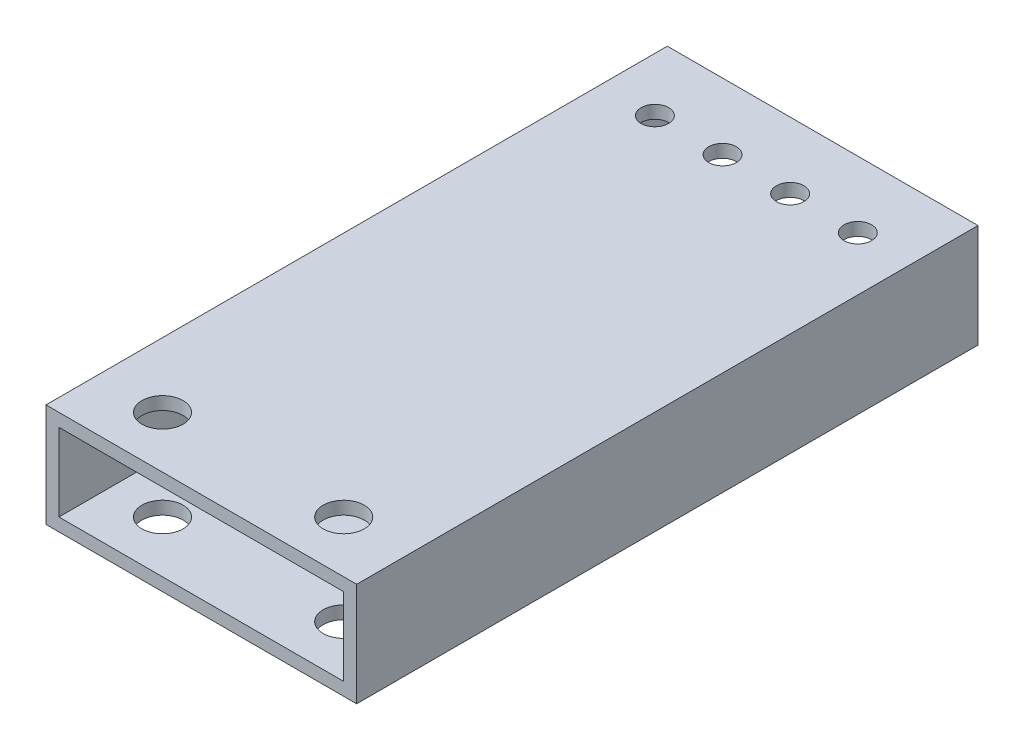
ISO-10303-21;
HEADER;
FILE_DESCRIPTION(('STEP AP214'),'2;1');
FILE_NAME('part.step','',(''),(''),'','','');
FILE_SCHEMA(('AUTOMOTIVE_DESIGN { 1 0 10303 214 1 1 1 1 }'));
ENDSEC;
DATA;
#1=APPLICATION_CONTEXT('core data for automotive mechanical design processes');
#2=APPLICATION_PROTOCOL_DEFINITION('international standard','automotive_design',2000,#1);
#3=PRODUCT_CONTEXT('',#1,'mechanical');
#4=PRODUCT('Part','Part','',(#3));
#5=PRODUCT_RELATED_PRODUCT_CATEGORY('part','',(#4));
#6=PRODUCT_DEFINITION_FORMATION('','',#4);
#7=PRODUCT_DEFINITION_CONTEXT('part definition',#1,'design');
#8=PRODUCT_DEFINITION('design','',#6,#7);
#9=PRODUCT_DEFINITION_SHAPE('','',#8);
#10=(LENGTH_UNIT() NAMED_UNIT(*) SI_UNIT(.MILLI.,.METRE.));
#11=(NAMED_UNIT(*) PLANE_ANGLE_UNIT() SI_UNIT($,.RADIAN.));
#12=(NAMED_UNIT(*) SI_UNIT($,.STERADIAN.) SOLID_ANGLE_UNIT());
#13=UNCERTAINTY_MEASURE_WITH_UNIT(LENGTH_MEASURE(1.E-05),#10,'distance_accuracy_value','');
#14=(GEOMETRIC_REPRESENTATION_CONTEXT(3) GLOBAL_UNCERTAINTY_ASSIGNED_CONTEXT((#13)) GLOBAL_UNIT_ASSIGNED_CONTEXT((#10,
#11,#12)) REPRESENTATION_CONTEXT('',''));
#15=CARTESIAN_POINT('',(0.,0.,0.));
#16=DIRECTION('',(0.,0.,1.));
#17=DIRECTION('',(1.,0.,0.));
#18=AXIS2_PLACEMENT_3D('',#15,#16,#17);
#19=CARTESIAN_POINT('',(0.,0.,152.4));
#20=DIRECTION('',(0.,0.,-1.));
#21=DIRECTION('',(-1.,0.,0.));
#22=AXIS2_PLACEMENT_3D('',#19,#20,#21);
#23=PLANE('',#22);
#24=DIRECTION('',(0.,-1.,0.));
#25=VECTOR('',#24,1.);
#26=CARTESIAN_POINT('',(0.,0.,152.4));
#27=LINE('',#26,#25);
#28=CARTESIAN_POINT('',(0.,25.4,152.4));
#29=VERTEX_POINT('',#28);
#30=CARTESIAN_POINT('',(0.,0.,152.4));
#31=VERTEX_POINT('',#30);
#32=EDGE_CURVE('E139',#29,#31,#27,.T.);
#33=ORIENTED_EDGE('',*,*,#32,.T.);
#34=DIRECTION('',(1.,0.,0.));
#35=VECTOR('',#34,1.);
#36=CARTESIAN_POINT('',(0.,0.,152.4));
#37=LINE('',#36,#35);
#38=CARTESIAN_POINT('',(76.2,0.,152.4));
#39=VERTEX_POINT('',#38);
#40=EDGE_CURVE('E142',#31,#39,#37,.T.);
#41=ORIENTED_EDGE('',*,*,#40,.T.);
#42=DIRECTION('',(0.,1.,0.));
#43=VECTOR('',#42,1.);
#44=CARTESIAN_POINT('',(76.2,0.,152.4));
#45=LINE('',#44,#43);
#46=CARTESIAN_POINT('',(76.2,25.4,152.4));
#47=VERTEX_POINT('',#46);
#48=EDGE_CURVE('E145',#39,#47,#45,.T.);
#49=ORIENTED_EDGE('',*,*,#48,.T.);
#50=DIRECTION('',(-1.,0.,0.));
#51=VECTOR('',#50,1.);
#52=CARTESIAN_POINT('',(0.,25.4,152.4));
#53=LINE('',#52,#51);
#54=EDGE_CURVE('E147',#47,#29,#53,.T.);
#55=ORIENTED_EDGE('',*,*,#54,.T.);
#56=EDGE_LOOP('',(#33,#41,#49,#55));
#57=FACE_BOUND('',#56,.T.);
#58=DIRECTION('',(0.,-1.,0.));
#59=VECTOR('',#58,1.);
#60=CARTESIAN_POINT('',(3.175,3.175,152.4));
#61=LINE('',#60,#59);
#62=CARTESIAN_POINT('',(3.175,22.225,152.4));
#63=VERTEX_POINT('',#62);
#64=CARTESIAN_POINT('',(3.175,3.175,152.4));
#65=VERTEX_POINT('',#64);
#66=EDGE_CURVE('E101',#63,#65,#61,.T.);
#67=ORIENTED_EDGE('',*,*,#66,.F.);
#68=DIRECTION('',(-1.,0.,0.));
#69=VECTOR('',#68,1.);
#70=CARTESIAN_POINT('',(3.175,22.225,152.4));
#71=LINE('',#70,#69);
#72=CARTESIAN_POINT('',(73.025,22.225,152.4));
#73=VERTEX_POINT('',#72);
#74=EDGE_CURVE('E123',#73,#63,#71,.T.);
#75=ORIENTED_EDGE('',*,*,#74,.F.);
#76=DIRECTION('',(0.,1.,0.));
#77=VECTOR('',#76,1.);
#78=CARTESIAN_POINT('',(73.025,3.175,152.4));
#79=LINE('',#78,#77);
#80=CARTESIAN_POINT('',(73.025,3.175,152.4));
#81=VERTEX_POINT('',#80);
#82=EDGE_CURVE('E121',#81,#73,#79,.T.);
#83=ORIENTED_EDGE('',*,*,#82,.F.);
#84=DIRECTION('',(1.,0.,0.));
#85=VECTOR('',#84,1.);
#86=CARTESIAN_POINT('',(3.175,3.175,152.4));
#87=LINE('',#86,#85);
#88=EDGE_CURVE('E109',#65,#81,#87,.T.);
#89=ORIENTED_EDGE('',*,*,#88,.F.);
#90=EDGE_LOOP('',(#67,#75,#83,#89));
#91=FACE_BOUND('',#90,.T.);
#92=ADVANCED_FACE('F34',(#57,#91),#23,.F.);
#93=CARTESIAN_POINT('',(0.,0.,0.));
#94=DIRECTION('',(0.,0.,-1.));
#95=DIRECTION('',(-1.,0.,0.));
#96=AXIS2_PLACEMENT_3D('',#93,#94,#95);
#97=PLANE('',#96);
#98=DIRECTION('',(0.,-1.,0.));
#99=VECTOR('',#98,1.);
#100=CARTESIAN_POINT('',(0.,0.,0.));
#101=LINE('',#100,#99);
#102=CARTESIAN_POINT('',(0.,25.4,0.));
#103=VERTEX_POINT('',#102);
#104=CARTESIAN_POINT('',(0.,0.,0.));
#105=VERTEX_POINT('',#104);
#106=EDGE_CURVE('E117',#103,#105,#101,.T.);
#107=ORIENTED_EDGE('',*,*,#106,.F.);
#108=DIRECTION('',(-1.,0.,0.));
#109=VECTOR('',#108,1.);
#110=CARTESIAN_POINT('',(0.,25.4,0.));
#111=LINE('',#110,#109);
#112=CARTESIAN_POINT('',(76.2,25.4,0.));
#113=VERTEX_POINT('',#112);
#114=EDGE_CURVE('E143',#113,#103,#111,.T.);
#115=ORIENTED_EDGE('',*,*,#114,.F.);
#116=DIRECTION('',(0.,1.,0.));
#117=VECTOR('',#116,1.);
#118=CARTESIAN_POINT('',(76.2,0.,0.));
#119=LINE('',#118,#117);
#120=CARTESIAN_POINT('',(76.2,0.,0.));
#121=VERTEX_POINT('',#120);
#122=EDGE_CURVE('E154',#121,#113,#119,.T.);
#123=ORIENTED_EDGE('',*,*,#122,.F.);
#124=DIRECTION('',(1.,0.,0.));
#125=VECTOR('',#124,1.);
#126=CARTESIAN_POINT('',(0.,0.,0.));
#127=LINE('',#126,#125);
#128=EDGE_CURVE('E152',#105,#121,#127,.T.);
#129=ORIENTED_EDGE('',*,*,#128,.F.);
#130=EDGE_LOOP('',(#107,#115,#123,#129));
#131=FACE_BOUND('',#130,.T.);
#132=DIRECTION('',(-1.,0.,0.));
#133=VECTOR('',#132,1.);
#134=CARTESIAN_POINT('',(3.175,22.225,0.));
#135=LINE('',#134,#133);
#136=CARTESIAN_POINT('',(73.025,22.225,0.));
#137=VERTEX_POINT('',#136);
#138=CARTESIAN_POINT('',(3.175,22.225,0.));
#139=VERTEX_POINT('',#138);
#140=EDGE_CURVE('E110',#137,#139,#135,.T.);
#141=ORIENTED_EDGE('',*,*,#140,.T.);
#142=DIRECTION('',(0.,-1.,0.));
#143=VECTOR('',#142,1.);
#144=CARTESIAN_POINT('',(3.175,3.175,0.));
#145=LINE('',#144,#143);
#146=CARTESIAN_POINT('',(3.175,3.175,0.));
#147=VERTEX_POINT('',#146);
#148=EDGE_CURVE('E59',#139,#147,#145,.T.);
#149=ORIENTED_EDGE('',*,*,#148,.T.);
#150=DIRECTION('',(1.,0.,0.));
#151=VECTOR('',#150,1.);
#152=CARTESIAN_POINT('',(3.175,3.175,0.));
#153=LINE('',#152,#151);
#154=CARTESIAN_POINT('',(73.025,3.175,0.));
#155=VERTEX_POINT('',#154);
#156=EDGE_CURVE('E116',#147,#155,#153,.T.);
#157=ORIENTED_EDGE('',*,*,#156,.T.);
#158=DIRECTION('',(0.,1.,0.));
#159=VECTOR('',#158,1.);
#160=CARTESIAN_POINT('',(73.025,3.175,0.));
#161=LINE('',#160,#159);
#162=EDGE_CURVE('E131',#155,#137,#161,.T.);
#163=ORIENTED_EDGE('',*,*,#162,.T.);
#164=EDGE_LOOP('',(#141,#149,#157,#163));
#165=FACE_BOUND('',#164,.T.);
#166=ADVANCED_FACE('F248',(#131,#165),#97,.T.);
#167=CARTESIAN_POINT('',(0.,0.,152.4));
#168=DIRECTION('',(1.,0.,0.));
#169=DIRECTION('',(0.,0.,-1.));
#170=AXIS2_PLACEMENT_3D('',#167,#168,#169);
#171=PLANE('',#170);
#172=ORIENTED_EDGE('',*,*,#106,.T.);
#173=DIRECTION('',(0.,0.,-1.));
#174=VECTOR('',#173,1.);
#175=CARTESIAN_POINT('',(0.,0.,152.4));
#176=LINE('',#175,#174);
#177=EDGE_CURVE('E11',#31,#105,#176,.T.);
#178=ORIENTED_EDGE('',*,*,#177,.F.);
#179=ORIENTED_EDGE('',*,*,#32,.F.);
#180=DIRECTION('',(0.,0.,-1.));
#181=VECTOR('',#180,1.);
#182=CARTESIAN_POINT('',(0.,25.4,152.4));
#183=LINE('',#182,#181);
#184=EDGE_CURVE('E149',#29,#103,#183,.T.);
#185=ORIENTED_EDGE('',*,*,#184,.T.);
#186=EDGE_LOOP('',(#172,#178,#179,#185));
#187=FACE_BOUND('',#186,.T.);
#188=ADVANCED_FACE('F36',(#187),#171,.F.);
#189=CARTESIAN_POINT('',(0.,0.,152.4));
#190=DIRECTION('',(0.,1.,0.));
#191=DIRECTION('',(0.,0.,1.));
#192=AXIS2_PLACEMENT_3D('',#189,#190,#191);
#193=PLANE('',#192);
#194=CARTESIAN_POINT('',(15.875,0.,139.7));
#195=DIRECTION('',(0.,-1.,0.));
#196=DIRECTION('',(0.,0.,-1.));
#197=AXIS2_PLACEMENT_3D('',#194,#195,#196);
#198=CIRCLE('',#197,5.0419);
#199=CARTESIAN_POINT('',(15.875,0.,134.6581));
#200=VERTEX_POINT('',#199);
#201=EDGE_CURVE('E273',#200,#200,#198,.T.);
#202=ORIENTED_EDGE('',*,*,#201,.F.);
#203=EDGE_LOOP('',(#202));
#204=FACE_BOUND('',#203,.T.);
#205=CARTESIAN_POINT('',(60.325,0.,139.7));
#206=DIRECTION('',(0.,-1.,0.));
#207=DIRECTION('',(0.,0.,-1.));
#208=AXIS2_PLACEMENT_3D('',#205,#206,#207);
#209=CIRCLE('',#208,5.0419);
#210=CARTESIAN_POINT('',(60.325,0.,134.6581));
#211=VERTEX_POINT('',#210);
#212=EDGE_CURVE('E190',#211,#211,#209,.T.);
#213=ORIENTED_EDGE('',*,*,#212,.F.);
#214=EDGE_LOOP('',(#213));
#215=FACE_BOUND('',#214,.T.);
#216=CARTESIAN_POINT('',(29.8043599999996,0.,16.2687000000003));
#217=DIRECTION('',(0.,1.,0.));
#218=DIRECTION('',(0.,0.,1.));
#219=AXIS2_PLACEMENT_3D('',#216,#217,#218);
#220=CIRCLE('',#219,3.3782);
#221=CARTESIAN_POINT('',(29.8043599999996,0.,19.6469000000003));
#222=VERTEX_POINT('',#221);
#223=EDGE_CURVE('E172',#222,#222,#220,.T.);
#224=ORIENTED_EDGE('',*,*,#223,.T.);
#225=EDGE_LOOP('',(#224));
#226=FACE_BOUND('',#225,.T.);
#227=CARTESIAN_POINT('',(46.3956399999996,0.,16.2687000000003));
#228=DIRECTION('',(0.,1.,0.));
#229=DIRECTION('',(0.,0.,1.));
#230=AXIS2_PLACEMENT_3D('',#227,#228,#229);
#231=CIRCLE('',#230,3.3782);
#232=CARTESIAN_POINT('',(46.3956399999996,0.,19.6469000000003));
#233=VERTEX_POINT('',#232);
#234=EDGE_CURVE('E205',#233,#233,#231,.T.);
#235=ORIENTED_EDGE('',*,*,#234,.T.);
#236=EDGE_LOOP('',(#235));
#237=FACE_BOUND('',#236,.T.);
#238=CARTESIAN_POINT('',(62.9869199999996,0.,16.2687000000003));
#239=DIRECTION('',(0.,1.,0.));
#240=DIRECTION('',(0.,0.,1.));
#241=AXIS2_PLACEMENT_3D('',#238,#239,#240);
#242=CIRCLE('',#241,3.37819999999999);
#243=CARTESIAN_POINT('',(62.9869199999996,0.,19.6469000000003));
#244=VERTEX_POINT('',#243);
#245=EDGE_CURVE('E211',#244,#244,#242,.T.);
#246=ORIENTED_EDGE('',*,*,#245,.T.);
#247=EDGE_LOOP('',(#246));
#248=FACE_BOUND('',#247,.T.);
#249=CARTESIAN_POINT('',(13.2130799999996,0.,16.2687000000003));
#250=DIRECTION('',(0.,1.,0.));
#251=DIRECTION('',(0.,0.,1.));
#252=AXIS2_PLACEMENT_3D('',#249,#250,#251);
#253=CIRCLE('',#252,3.37819999999999);
#254=CARTESIAN_POINT('',(13.2130799999996,0.,19.6469000000003));
#255=VERTEX_POINT('',#254);
#256=EDGE_CURVE('E167',#255,#255,#253,.T.);
#257=ORIENTED_EDGE('',*,*,#256,.T.);
#258=EDGE_LOOP('',(#257));
#259=FACE_BOUND('',#258,.T.);
#260=ORIENTED_EDGE('',*,*,#128,.T.);
#261=DIRECTION('',(0.,0.,-1.));
#262=VECTOR('',#261,1.);
#263=CARTESIAN_POINT('',(76.2,0.,152.4));
#264=LINE('',#263,#262);
#265=EDGE_CURVE('E43',#39,#121,#264,.T.);
#266=ORIENTED_EDGE('',*,*,#265,.F.);
#267=ORIENTED_EDGE('',*,*,#40,.F.);
#268=ORIENTED_EDGE('',*,*,#177,.T.);
#269=EDGE_LOOP('',(#260,#266,#267,#268));
#270=FACE_BOUND('',#269,.T.);
#271=ADVANCED_FACE('F262',(#204,#215,#226,#237,#248,#259,#270),#193,.F.);
#272=CARTESIAN_POINT('',(76.2,0.,152.4));
#273=DIRECTION('',(-1.,0.,0.));
#274=DIRECTION('',(0.,0.,1.));
#275=AXIS2_PLACEMENT_3D('',#272,#273,#274);
#276=PLANE('',#275);
#277=ORIENTED_EDGE('',*,*,#122,.T.);
#278=DIRECTION('',(0.,0.,-1.));
#279=VECTOR('',#278,1.);
#280=CARTESIAN_POINT('',(76.2,25.4,152.4));
#281=LINE('',#280,#279);
#282=EDGE_CURVE('E159',#47,#113,#281,.T.);
#283=ORIENTED_EDGE('',*,*,#282,.F.);
#284=ORIENTED_EDGE('',*,*,#48,.F.);
#285=ORIENTED_EDGE('',*,*,#265,.T.);
#286=EDGE_LOOP('',(#277,#283,#284,#285));
#287=FACE_BOUND('',#286,.T.);
#288=ADVANCED_FACE('F259',(#287),#276,.F.);
#289=CARTESIAN_POINT('',(0.,25.4,152.4));
#290=DIRECTION('',(0.,-1.,0.));
#291=DIRECTION('',(0.,0.,-1.));
#292=AXIS2_PLACEMENT_3D('',#289,#290,#291);
#293=PLANE('',#292);
#294=CARTESIAN_POINT('',(15.875,25.4,139.7));
#295=DIRECTION('',(0.,-1.,0.));
#296=DIRECTION('',(0.,0.,-1.));
#297=AXIS2_PLACEMENT_3D('',#294,#295,#296);
#298=CIRCLE('',#297,5.0419);
#299=CARTESIAN_POINT('',(15.875,25.4,134.6581));
#300=VERTEX_POINT('',#299);
#301=EDGE_CURVE('E342',#300,#300,#298,.T.);
#302=ORIENTED_EDGE('',*,*,#301,.T.);
#303=EDGE_LOOP('',(#302));
#304=FACE_BOUND('',#303,.T.);
#305=CARTESIAN_POINT('',(60.325,25.4,139.7));
#306=DIRECTION('',(0.,-1.,0.));
#307=DIRECTION('',(0.,0.,-1.));
#308=AXIS2_PLACEMENT_3D('',#305,#306,#307);
#309=CIRCLE('',#308,5.0419);
#310=CARTESIAN_POINT('',(60.325,25.4,134.6581));
#311=VERTEX_POINT('',#310);
#312=EDGE_CURVE('E183',#311,#311,#309,.T.);
#313=ORIENTED_EDGE('',*,*,#312,.T.);
#314=EDGE_LOOP('',(#313));
#315=FACE_BOUND('',#314,.T.);
#316=CARTESIAN_POINT('',(29.8043599999996,25.4,16.2687000000003));
#317=DIRECTION('',(0.,1.,0.));
#318=DIRECTION('',(0.,0.,1.));
#319=AXIS2_PLACEMENT_3D('',#316,#317,#318);
#320=CIRCLE('',#319,3.3782);
#321=CARTESIAN_POINT('',(29.8043599999996,25.4,19.6469000000003));
#322=VERTEX_POINT('',#321);
#323=EDGE_CURVE('E202',#322,#322,#320,.T.);
#324=ORIENTED_EDGE('',*,*,#323,.F.);
#325=EDGE_LOOP('',(#324));
#326=FACE_BOUND('',#325,.T.);
#327=CARTESIAN_POINT('',(46.3956399999996,25.4,16.2687000000003));
#328=DIRECTION('',(0.,1.,0.));
#329=DIRECTION('',(0.,0.,1.));
#330=AXIS2_PLACEMENT_3D('',#327,#328,#329);
#331=CIRCLE('',#330,3.3782);
#332=CARTESIAN_POINT('',(46.3956399999996,25.4,19.6469000000003));
#333=VERTEX_POINT('',#332);
#334=EDGE_CURVE('E208',#333,#333,#331,.T.);
#335=ORIENTED_EDGE('',*,*,#334,.F.);
#336=EDGE_LOOP('',(#335));
#337=FACE_BOUND('',#336,.T.);
#338=CARTESIAN_POINT('',(62.9869199999996,25.4,16.2687000000003));
#339=DIRECTION('',(0.,1.,0.));
#340=DIRECTION('',(0.,0.,1.));
#341=AXIS2_PLACEMENT_3D('',#338,#339,#340);
#342=CIRCLE('',#341,3.37819999999999);
#343=CARTESIAN_POINT('',(62.9869199999996,25.4,19.6469000000003));
#344=VERTEX_POINT('',#343);
#345=EDGE_CURVE('E187',#344,#344,#342,.T.);
#346=ORIENTED_EDGE('',*,*,#345,.F.);
#347=EDGE_LOOP('',(#346));
#348=FACE_BOUND('',#347,.T.);
#349=CARTESIAN_POINT('',(13.2130799999996,25.4,16.2687000000003));
#350=DIRECTION('',(0.,1.,0.));
#351=DIRECTION('',(0.,0.,1.));
#352=AXIS2_PLACEMENT_3D('',#349,#350,#351);
#353=CIRCLE('',#352,3.37819999999999);
#354=CARTESIAN_POINT('',(13.2130799999996,25.4,19.6469000000003));
#355=VERTEX_POINT('',#354);
#356=EDGE_CURVE('E222',#355,#355,#353,.T.);
#357=ORIENTED_EDGE('',*,*,#356,.F.);
#358=EDGE_LOOP('',(#357));
#359=FACE_BOUND('',#358,.T.);
#360=ORIENTED_EDGE('',*,*,#114,.T.);
#361=ORIENTED_EDGE('',*,*,#184,.F.);
#362=ORIENTED_EDGE('',*,*,#54,.F.);
#363=ORIENTED_EDGE('',*,*,#282,.T.);
#364=EDGE_LOOP('',(#360,#361,#362,#363));
#365=FACE_BOUND('',#364,.T.);
#366=ADVANCED_FACE('F243',(#304,#315,#326,#337,#348,#359,#365),#293,.F.);
#367=CARTESIAN_POINT('',(3.175,3.175,152.4));
#368=DIRECTION('',(1.,0.,0.));
#369=DIRECTION('',(0.,0.,-1.));
#370=AXIS2_PLACEMENT_3D('',#367,#368,#369);
#371=PLANE('',#370);
#372=ORIENTED_EDGE('',*,*,#148,.F.);
#373=DIRECTION('',(0.,0.,-1.));
#374=VECTOR('',#373,1.);
#375=CARTESIAN_POINT('',(3.175,22.225,152.4));
#376=LINE('',#375,#374);
#377=EDGE_CURVE('E105',#63,#139,#376,.T.);
#378=ORIENTED_EDGE('',*,*,#377,.F.);
#379=ORIENTED_EDGE('',*,*,#66,.T.);
#380=DIRECTION('',(0.,0.,-1.));
#381=VECTOR('',#380,1.);
#382=CARTESIAN_POINT('',(3.175,3.175,152.4));
#383=LINE('',#382,#381);
#384=EDGE_CURVE('E104',#65,#147,#383,.T.);
#385=ORIENTED_EDGE('',*,*,#384,.T.);
#386=EDGE_LOOP('',(#372,#378,#379,#385));
#387=FACE_BOUND('',#386,.T.);
#388=ADVANCED_FACE('F103',(#387),#371,.T.);
#389=CARTESIAN_POINT('',(3.175,3.175,152.4));
#390=DIRECTION('',(0.,1.,0.));
#391=DIRECTION('',(0.,0.,1.));
#392=AXIS2_PLACEMENT_3D('',#389,#390,#391);
#393=PLANE('',#392);
#394=CARTESIAN_POINT('',(15.875,3.175,139.7));
#395=DIRECTION('',(0.,1.,0.));
#396=DIRECTION('',(0.,0.,1.));
#397=AXIS2_PLACEMENT_3D('',#394,#395,#396);
#398=CIRCLE('',#397,5.0419);
#399=CARTESIAN_POINT('',(15.875,3.175,144.7419));
#400=VERTEX_POINT('',#399);
#401=EDGE_CURVE('E195',#400,#400,#398,.T.);
#402=ORIENTED_EDGE('',*,*,#401,.F.);
#403=EDGE_LOOP('',(#402));
#404=FACE_BOUND('',#403,.T.);
#405=CARTESIAN_POINT('',(60.325,3.175,139.7));
#406=DIRECTION('',(0.,1.,0.));
#407=DIRECTION('',(0.,0.,1.));
#408=AXIS2_PLACEMENT_3D('',#405,#406,#407);
#409=CIRCLE('',#408,5.0419);
#410=CARTESIAN_POINT('',(60.325,3.175,144.7419));
#411=VERTEX_POINT('',#410);
#412=EDGE_CURVE('E182',#411,#411,#409,.T.);
#413=ORIENTED_EDGE('',*,*,#412,.F.);
#414=EDGE_LOOP('',(#413));
#415=FACE_BOUND('',#414,.T.);
#416=CARTESIAN_POINT('',(29.8043599999996,3.175,16.2687000000003));
#417=DIRECTION('',(0.,1.,0.));
#418=DIRECTION('',(0.,0.,1.));
#419=AXIS2_PLACEMENT_3D('',#416,#417,#418);
#420=CIRCLE('',#419,3.3782);
#421=CARTESIAN_POINT('',(29.8043599999996,3.175,19.6469000000003));
#422=VERTEX_POINT('',#421);
#423=EDGE_CURVE('E179',#422,#422,#420,.T.);
#424=ORIENTED_EDGE('',*,*,#423,.F.);
#425=EDGE_LOOP('',(#424));
#426=FACE_BOUND('',#425,.T.);
#427=CARTESIAN_POINT('',(46.3956399999996,3.175,16.2687000000003));
#428=DIRECTION('',(0.,1.,0.));
#429=DIRECTION('',(0.,0.,1.));
#430=AXIS2_PLACEMENT_3D('',#427,#428,#429);
#431=CIRCLE('',#430,3.3782);
#432=CARTESIAN_POINT('',(46.3956399999996,3.175,19.6469000000003));
#433=VERTEX_POINT('',#432);
#434=EDGE_CURVE('E176',#433,#433,#431,.T.);
#435=ORIENTED_EDGE('',*,*,#434,.F.);
#436=EDGE_LOOP('',(#435));
#437=FACE_BOUND('',#436,.T.);
#438=CARTESIAN_POINT('',(62.9869199999996,3.175,16.2687000000003));
#439=DIRECTION('',(0.,1.,0.));
#440=DIRECTION('',(0.,0.,1.));
#441=AXIS2_PLACEMENT_3D('',#438,#439,#440);
#442=CIRCLE('',#441,3.37819999999999);
#443=CARTESIAN_POINT('',(62.9869199999996,3.175,19.6469000000003));
#444=VERTEX_POINT('',#443);
#445=EDGE_CURVE('E171',#444,#444,#442,.T.);
#446=ORIENTED_EDGE('',*,*,#445,.F.);
#447=EDGE_LOOP('',(#446));
#448=FACE_BOUND('',#447,.T.);
#449=CARTESIAN_POINT('',(13.2130799999996,3.175,16.2687000000003));
#450=DIRECTION('',(0.,1.,0.));
#451=DIRECTION('',(0.,0.,1.));
#452=AXIS2_PLACEMENT_3D('',#449,#450,#451);
#453=CIRCLE('',#452,3.37819999999999);
#454=CARTESIAN_POINT('',(13.2130799999996,3.175,19.6469000000003));
#455=VERTEX_POINT('',#454);
#456=EDGE_CURVE('E129',#455,#455,#453,.T.);
#457=ORIENTED_EDGE('',*,*,#456,.F.);
#458=EDGE_LOOP('',(#457));
#459=FACE_BOUND('',#458,.T.);
#460=ORIENTED_EDGE('',*,*,#156,.F.);
#461=ORIENTED_EDGE('',*,*,#384,.F.);
#462=ORIENTED_EDGE('',*,*,#88,.T.);
#463=DIRECTION('',(0.,0.,-1.));
#464=VECTOR('',#463,1.);
#465=CARTESIAN_POINT('',(73.025,3.175,152.4));
#466=LINE('',#465,#464);
#467=EDGE_CURVE('E118',#81,#155,#466,.T.);
#468=ORIENTED_EDGE('',*,*,#467,.T.);
#469=EDGE_LOOP('',(#460,#461,#462,#468));
#470=FACE_BOUND('',#469,.T.);
#471=ADVANCED_FACE('F113',(#404,#415,#426,#437,#448,#459,#470),#393,.T.);
#472=CARTESIAN_POINT('',(73.025,3.175,152.4));
#473=DIRECTION('',(-1.,0.,0.));
#474=DIRECTION('',(0.,0.,1.));
#475=AXIS2_PLACEMENT_3D('',#472,#473,#474);
#476=PLANE('',#475);
#477=ORIENTED_EDGE('',*,*,#162,.F.);
#478=ORIENTED_EDGE('',*,*,#467,.F.);
#479=ORIENTED_EDGE('',*,*,#82,.T.);
#480=DIRECTION('',(0.,0.,-1.));
#481=VECTOR('',#480,1.);
#482=CARTESIAN_POINT('',(73.025,22.225,152.4));
#483=LINE('',#482,#481);
#484=EDGE_CURVE('E51',#73,#137,#483,.T.);
#485=ORIENTED_EDGE('',*,*,#484,.T.);
#486=EDGE_LOOP('',(#477,#478,#479,#485));
#487=FACE_BOUND('',#486,.T.);
#488=ADVANCED_FACE('F233',(#487),#476,.T.);
#489=CARTESIAN_POINT('',(3.175,22.225,152.4));
#490=DIRECTION('',(0.,-1.,0.));
#491=DIRECTION('',(0.,0.,-1.));
#492=AXIS2_PLACEMENT_3D('',#489,#490,#491);
#493=PLANE('',#492);
#494=CARTESIAN_POINT('',(15.875,22.225,139.7));
#495=DIRECTION('',(0.,-1.,0.));
#496=DIRECTION('',(0.,0.,-1.));
#497=AXIS2_PLACEMENT_3D('',#494,#495,#496);
#498=CIRCLE('',#497,5.0419);
#499=CARTESIAN_POINT('',(15.875,22.225,134.6581));
#500=VERTEX_POINT('',#499);
#501=EDGE_CURVE('E38',#500,#500,#498,.T.);
#502=ORIENTED_EDGE('',*,*,#501,.F.);
#503=EDGE_LOOP('',(#502));
#504=FACE_BOUND('',#503,.T.);
#505=CARTESIAN_POINT('',(60.325,22.225,139.7));
#506=DIRECTION('',(0.,-1.,0.));
#507=DIRECTION('',(0.,0.,-1.));
#508=AXIS2_PLACEMENT_3D('',#505,#506,#507);
#509=CIRCLE('',#508,5.0419);
#510=CARTESIAN_POINT('',(60.325,22.225,134.6581));
#511=VERTEX_POINT('',#510);
#512=EDGE_CURVE('E180',#511,#511,#509,.T.);
#513=ORIENTED_EDGE('',*,*,#512,.F.);
#514=EDGE_LOOP('',(#513));
#515=FACE_BOUND('',#514,.T.);
#516=CARTESIAN_POINT('',(29.8043599999996,22.225,16.2687000000003));
#517=DIRECTION('',(0.,-1.,0.));
#518=DIRECTION('',(0.,0.,-1.));
#519=AXIS2_PLACEMENT_3D('',#516,#517,#518);
#520=CIRCLE('',#519,3.3782);
#521=CARTESIAN_POINT('',(29.8043599999996,22.225,12.8905000000003));
#522=VERTEX_POINT('',#521);
#523=EDGE_CURVE('E177',#522,#522,#520,.T.);
#524=ORIENTED_EDGE('',*,*,#523,.F.);
#525=EDGE_LOOP('',(#524));
#526=FACE_BOUND('',#525,.T.);
#527=CARTESIAN_POINT('',(46.3956399999996,22.225,16.2687000000003));
#528=DIRECTION('',(0.,-1.,0.));
#529=DIRECTION('',(0.,0.,-1.));
#530=AXIS2_PLACEMENT_3D('',#527,#528,#529);
#531=CIRCLE('',#530,3.3782);
#532=CARTESIAN_POINT('',(46.3956399999996,22.225,12.8905000000003));
#533=VERTEX_POINT('',#532);
#534=EDGE_CURVE('E173',#533,#533,#531,.T.);
#535=ORIENTED_EDGE('',*,*,#534,.F.);
#536=EDGE_LOOP('',(#535));
#537=FACE_BOUND('',#536,.T.);
#538=CARTESIAN_POINT('',(62.9869199999996,22.225,16.2687000000003));
#539=DIRECTION('',(0.,-1.,0.));
#540=DIRECTION('',(0.,0.,-1.));
#541=AXIS2_PLACEMENT_3D('',#538,#539,#540);
#542=CIRCLE('',#541,3.37819999999999);
#543=CARTESIAN_POINT('',(62.9869199999996,22.225,12.8905000000003));
#544=VERTEX_POINT('',#543);
#545=EDGE_CURVE('E168',#544,#544,#542,.T.);
#546=ORIENTED_EDGE('',*,*,#545,.F.);
#547=EDGE_LOOP('',(#546));
#548=FACE_BOUND('',#547,.T.);
#549=CARTESIAN_POINT('',(13.2130799999996,22.225,16.2687000000003));
#550=DIRECTION('',(0.,-1.,0.));
#551=DIRECTION('',(0.,0.,-1.));
#552=AXIS2_PLACEMENT_3D('',#549,#550,#551);
#553=CIRCLE('',#552,3.37819999999999);
#554=CARTESIAN_POINT('',(13.2130799999996,22.225,12.8905000000003));
#555=VERTEX_POINT('',#554);
#556=EDGE_CURVE('E164',#555,#555,#553,.T.);
#557=ORIENTED_EDGE('',*,*,#556,.F.);
#558=EDGE_LOOP('',(#557));
#559=FACE_BOUND('',#558,.T.);
#560=ORIENTED_EDGE('',*,*,#140,.F.);
#561=ORIENTED_EDGE('',*,*,#484,.F.);
#562=ORIENTED_EDGE('',*,*,#74,.T.);
#563=ORIENTED_EDGE('',*,*,#377,.T.);
#564=EDGE_LOOP('',(#560,#561,#562,#563));
#565=FACE_BOUND('',#564,.T.);
#566=ADVANCED_FACE('F240',(#504,#515,#526,#537,#548,#559,#565),#493,.T.);
#567=CARTESIAN_POINT('',(13.2130799999996,0.,16.2687000000003));
#568=DIRECTION('',(0.,1.,0.));
#569=DIRECTION('',(0.,0.,1.));
#570=AXIS2_PLACEMENT_3D('',#567,#568,#569);
#571=CYLINDRICAL_SURFACE('',#570,3.37819999999999);
#572=ORIENTED_EDGE('',*,*,#556,.T.);
#573=EDGE_LOOP('',(#572));
#574=FACE_BOUND('',#573,.T.);
#575=ORIENTED_EDGE('',*,*,#356,.T.);
#576=EDGE_LOOP('',(#575));
#577=FACE_BOUND('',#576,.T.);
#578=ADVANCED_FACE('F298',(#574,#577),#571,.F.);
#579=ORIENTED_EDGE('',*,*,#456,.T.);
#580=EDGE_LOOP('',(#579));
#581=FACE_BOUND('',#580,.T.);
#582=ORIENTED_EDGE('',*,*,#256,.F.);
#583=EDGE_LOOP('',(#582));
#584=FACE_BOUND('',#583,.T.);
#585=ADVANCED_FACE('F229',(#581,#584),#571,.F.);
#586=CARTESIAN_POINT('',(62.9869199999996,0.,16.2687000000003));
#587=DIRECTION('',(0.,1.,0.));
#588=DIRECTION('',(0.,0.,1.));
#589=AXIS2_PLACEMENT_3D('',#586,#587,#588);
#590=CYLINDRICAL_SURFACE('',#589,3.37819999999999);
#591=ORIENTED_EDGE('',*,*,#545,.T.);
#592=EDGE_LOOP('',(#591));
#593=FACE_BOUND('',#592,.T.);
#594=ORIENTED_EDGE('',*,*,#345,.T.);
#595=EDGE_LOOP('',(#594));
#596=FACE_BOUND('',#595,.T.);
#597=ADVANCED_FACE('F309',(#593,#596),#590,.F.);
#598=CARTESIAN_POINT('',(46.3956399999996,0.,16.2687000000003));
#599=DIRECTION('',(0.,1.,0.));
#600=DIRECTION('',(0.,0.,1.));
#601=AXIS2_PLACEMENT_3D('',#598,#599,#600);
#602=CYLINDRICAL_SURFACE('',#601,3.3782);
#603=ORIENTED_EDGE('',*,*,#534,.T.);
#604=EDGE_LOOP('',(#603));
#605=FACE_BOUND('',#604,.T.);
#606=ORIENTED_EDGE('',*,*,#334,.T.);
#607=EDGE_LOOP('',(#606));
#608=FACE_BOUND('',#607,.T.);
#609=ADVANCED_FACE('F312',(#605,#608),#602,.F.);
#610=CARTESIAN_POINT('',(29.8043599999996,0.,16.2687000000003));
#611=DIRECTION('',(0.,1.,0.));
#612=DIRECTION('',(0.,0.,1.));
#613=AXIS2_PLACEMENT_3D('',#610,#611,#612);
#614=CYLINDRICAL_SURFACE('',#613,3.3782);
#615=ORIENTED_EDGE('',*,*,#523,.T.);
#616=EDGE_LOOP('',(#615));
#617=FACE_BOUND('',#616,.T.);
#618=ORIENTED_EDGE('',*,*,#323,.T.);
#619=EDGE_LOOP('',(#618));
#620=FACE_BOUND('',#619,.T.);
#621=ADVANCED_FACE('F317',(#617,#620),#614,.F.);
#622=ORIENTED_EDGE('',*,*,#445,.T.);
#623=EDGE_LOOP('',(#622));
#624=FACE_BOUND('',#623,.T.);
#625=ORIENTED_EDGE('',*,*,#245,.F.);
#626=EDGE_LOOP('',(#625));
#627=FACE_BOUND('',#626,.T.);
#628=ADVANCED_FACE('F314',(#624,#627),#590,.F.);
#629=ORIENTED_EDGE('',*,*,#434,.T.);
#630=EDGE_LOOP('',(#629));
#631=FACE_BOUND('',#630,.T.);
#632=ORIENTED_EDGE('',*,*,#234,.F.);
#633=EDGE_LOOP('',(#632));
#634=FACE_BOUND('',#633,.T.);
#635=ADVANCED_FACE('F319',(#631,#634),#602,.F.);
#636=ORIENTED_EDGE('',*,*,#423,.T.);
#637=EDGE_LOOP('',(#636));
#638=FACE_BOUND('',#637,.T.);
#639=ORIENTED_EDGE('',*,*,#223,.F.);
#640=EDGE_LOOP('',(#639));
#641=FACE_BOUND('',#640,.T.);
#642=ADVANCED_FACE('F323',(#638,#641),#614,.F.);
#643=CARTESIAN_POINT('',(60.325,25.4,139.7));
#644=DIRECTION('',(0.,-1.,0.));
#645=DIRECTION('',(0.,0.,-1.));
#646=AXIS2_PLACEMENT_3D('',#643,#644,#645);
#647=CYLINDRICAL_SURFACE('',#646,5.0419);
#648=ORIENTED_EDGE('',*,*,#512,.T.);
#649=EDGE_LOOP('',(#648));
#650=FACE_BOUND('',#649,.T.);
#651=ORIENTED_EDGE('',*,*,#312,.F.);
#652=EDGE_LOOP('',(#651));
#653=FACE_BOUND('',#652,.T.);
#654=ADVANCED_FACE('F324',(#650,#653),#647,.F.);
#655=ORIENTED_EDGE('',*,*,#412,.T.);
#656=EDGE_LOOP('',(#655));
#657=FACE_BOUND('',#656,.T.);
#658=ORIENTED_EDGE('',*,*,#212,.T.);
#659=EDGE_LOOP('',(#658));
#660=FACE_BOUND('',#659,.T.);
#661=ADVANCED_FACE('F327',(#657,#660),#647,.F.);
#662=CARTESIAN_POINT('',(15.875,25.4,139.7));
#663=DIRECTION('',(0.,-1.,0.));
#664=DIRECTION('',(0.,0.,-1.));
#665=AXIS2_PLACEMENT_3D('',#662,#663,#664);
#666=CYLINDRICAL_SURFACE('',#665,5.0419);
#667=ORIENTED_EDGE('',*,*,#501,.T.);
#668=EDGE_LOOP('',(#667));
#669=FACE_BOUND('',#668,.T.);
#670=ORIENTED_EDGE('',*,*,#301,.F.);
#671=EDGE_LOOP('',(#670));
#672=FACE_BOUND('',#671,.T.);
#673=ADVANCED_FACE('F328',(#669,#672),#666,.F.);
#674=ORIENTED_EDGE('',*,*,#401,.T.);
#675=EDGE_LOOP('',(#674));
#676=FACE_BOUND('',#675,.T.);
#677=ORIENTED_EDGE('',*,*,#201,.T.);
#678=EDGE_LOOP('',(#677));
#679=FACE_BOUND('',#678,.T.);
#680=ADVANCED_FACE('F330',(#676,#679),#666,.F.);
#681=CLOSED_SHELL('',(#92,#166,#188,#271,#288,#366,#388,#471,#488,#566,#578,#585,#597,#609,#621,
#628,#635,#642,#654,#661,#673,#680));
#682=MANIFOLD_SOLID_BREP('B2',#681);
#683=ADVANCED_BREP_SHAPE_REPRESENTATION('',(#18,#682),#14);
#684=SHAPE_DEFINITION_REPRESENTATION(#9,#683);
ENDSEC;
END-ISO-10303-21;
